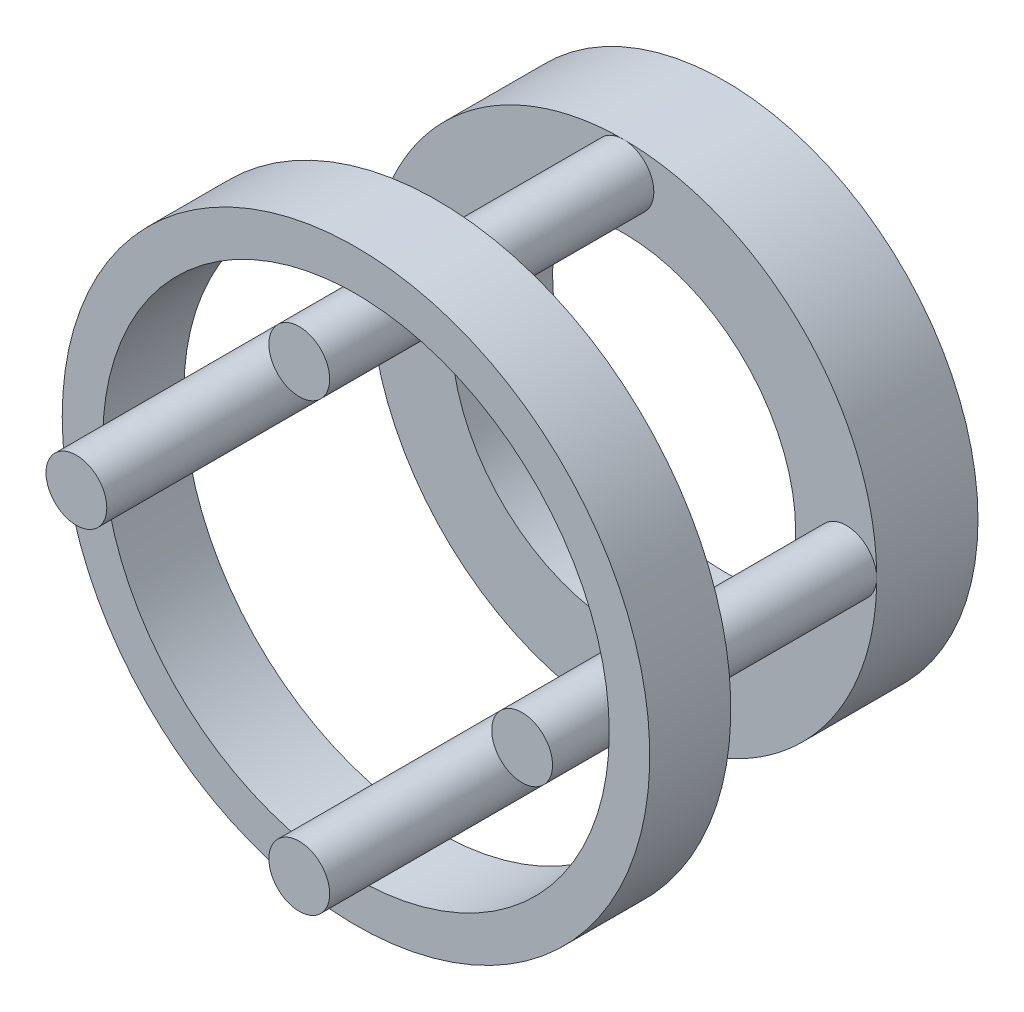
ISO-10303-21;
HEADER;
FILE_DESCRIPTION(('STEP AP214'),'2;1');
FILE_NAME('part.step','',(''),(''),'','','');
FILE_SCHEMA(('AUTOMOTIVE_DESIGN { 1 0 10303 214 1 1 1 1 }'));
ENDSEC;
DATA;
#1=APPLICATION_CONTEXT('core data for automotive mechanical design processes');
#2=APPLICATION_PROTOCOL_DEFINITION('international standard','automotive_design',2000,#1);
#3=PRODUCT_CONTEXT('',#1,'mechanical');
#4=PRODUCT('Part','Part','',(#3));
#5=PRODUCT_RELATED_PRODUCT_CATEGORY('part','',(#4));
#6=PRODUCT_DEFINITION_FORMATION('','',#4);
#7=PRODUCT_DEFINITION_CONTEXT('part definition',#1,'design');
#8=PRODUCT_DEFINITION('design','',#6,#7);
#9=PRODUCT_DEFINITION_SHAPE('','',#8);
#10=(LENGTH_UNIT() NAMED_UNIT(*) SI_UNIT(.MILLI.,.METRE.));
#11=(NAMED_UNIT(*) PLANE_ANGLE_UNIT() SI_UNIT($,.RADIAN.));
#12=(NAMED_UNIT(*) SI_UNIT($,.STERADIAN.) SOLID_ANGLE_UNIT());
#13=UNCERTAINTY_MEASURE_WITH_UNIT(LENGTH_MEASURE(1.E-05),#10,'distance_accuracy_value','');
#14=(GEOMETRIC_REPRESENTATION_CONTEXT(3) GLOBAL_UNCERTAINTY_ASSIGNED_CONTEXT((#13)) GLOBAL_UNIT_ASSIGNED_CONTEXT((#10,
#11,#12)) REPRESENTATION_CONTEXT('',''));
#15=CARTESIAN_POINT('',(0.,0.,0.));
#16=DIRECTION('',(0.,0.,1.));
#17=DIRECTION('',(1.,0.,0.));
#18=AXIS2_PLACEMENT_3D('',#15,#16,#17);
#19=CARTESIAN_POINT('',(1.13123995378518E-13,0.,16.2));
#20=DIRECTION('',(0.,0.,-1.));
#21=DIRECTION('',(-1.,0.,0.));
#22=AXIS2_PLACEMENT_3D('',#19,#20,#21);
#23=CYLINDRICAL_SURFACE('',#22,14.5);
#24=CARTESIAN_POINT('',(1.13123995378518E-13,0.,16.2));
#25=DIRECTION('',(0.,0.,-1.));
#26=DIRECTION('',(-1.,0.,0.));
#27=AXIS2_PLACEMENT_3D('',#24,#25,#26);
#28=CIRCLE('',#27,14.5);
#29=CARTESIAN_POINT('',(-14.4999999999999,0.,16.2000000000001));
#30=VERTEX_POINT('',#29);
#31=EDGE_CURVE('E11',#30,#30,#28,.T.);
#32=ORIENTED_EDGE('',*,*,#31,.T.);
#33=EDGE_LOOP('',(#32));
#34=FACE_BOUND('',#33,.T.);
#35=CARTESIAN_POINT('',(0.,0.,12.2));
#36=DIRECTION('',(0.,0.,-1.));
#37=DIRECTION('',(-1.,0.,0.));
#38=AXIS2_PLACEMENT_3D('',#35,#36,#37);
#39=CIRCLE('',#38,14.5);
#40=CARTESIAN_POINT('',(-14.4999999999999,0.,12.2000000000001));
#41=VERTEX_POINT('',#40);
#42=EDGE_CURVE('E48',#41,#41,#39,.T.);
#43=ORIENTED_EDGE('',*,*,#42,.F.);
#44=EDGE_LOOP('',(#43));
#45=FACE_BOUND('',#44,.T.);
#46=ADVANCED_FACE('F45',(#34,#45),#23,.T.);
#47=CARTESIAN_POINT('',(1.13123995378518E-13,0.,16.2));
#48=DIRECTION('',(0.,0.,-1.));
#49=DIRECTION('',(-1.,0.,0.));
#50=AXIS2_PLACEMENT_3D('',#47,#48,#49);
#51=PLANE('',#50);
#52=CARTESIAN_POINT('',(1.13123995378518E-13,0.,16.2));
#53=DIRECTION('',(0.,0.,-1.));
#54=DIRECTION('',(-1.,0.,0.));
#55=AXIS2_PLACEMENT_3D('',#52,#53,#54);
#56=CIRCLE('',#55,12.5);
#57=CARTESIAN_POINT('',(-12.4999999999999,0.,16.2000000000001));
#58=VERTEX_POINT('',#57);
#59=EDGE_CURVE('E55',#58,#58,#56,.T.);
#60=ORIENTED_EDGE('',*,*,#59,.T.);
#61=EDGE_LOOP('',(#60));
#62=FACE_BOUND('',#61,.T.);
#63=ORIENTED_EDGE('',*,*,#31,.F.);
#64=EDGE_LOOP('',(#63));
#65=FACE_BOUND('',#64,.T.);
#66=ADVANCED_FACE('F63',(#62,#65),#51,.F.);
#67=CARTESIAN_POINT('',(0.,0.,12.2));
#68=DIRECTION('',(0.,0.,-1.));
#69=DIRECTION('',(-1.,0.,0.));
#70=AXIS2_PLACEMENT_3D('',#67,#68,#69);
#71=PLANE('',#70);
#72=CARTESIAN_POINT('',(0.,0.,12.2));
#73=DIRECTION('',(0.,0.,-1.));
#74=DIRECTION('',(-1.,0.,0.));
#75=AXIS2_PLACEMENT_3D('',#72,#73,#74);
#76=CIRCLE('',#75,12.5);
#77=CARTESIAN_POINT('',(-12.4999999999999,0.,12.2000000000001));
#78=VERTEX_POINT('',#77);
#79=EDGE_CURVE('E57',#78,#78,#76,.T.);
#80=ORIENTED_EDGE('',*,*,#79,.F.);
#81=EDGE_LOOP('',(#80));
#82=FACE_BOUND('',#81,.T.);
#83=ORIENTED_EDGE('',*,*,#42,.T.);
#84=EDGE_LOOP('',(#83));
#85=FACE_BOUND('',#84,.T.);
#86=ADVANCED_FACE('F69',(#82,#85),#71,.T.);
#87=CARTESIAN_POINT('',(1.13123995378518E-13,0.,16.2));
#88=DIRECTION('',(0.,0.,-1.));
#89=DIRECTION('',(-1.,0.,0.));
#90=AXIS2_PLACEMENT_3D('',#87,#88,#89);
#91=CYLINDRICAL_SURFACE('',#90,12.5);
#92=ORIENTED_EDGE('',*,*,#59,.F.);
#93=EDGE_LOOP('',(#92));
#94=FACE_BOUND('',#93,.T.);
#95=ORIENTED_EDGE('',*,*,#79,.T.);
#96=EDGE_LOOP('',(#95));
#97=FACE_BOUND('',#96,.T.);
#98=ADVANCED_FACE('F66',(#94,#97),#91,.F.);
#99=CLOSED_SHELL('',(#46,#66,#86,#98));
#100=MANIFOLD_SOLID_BREP('B2',#99);
#101=CARTESIAN_POINT('',(0.,0.,21.));
#102=DIRECTION('',(0.,0.,-1.));
#103=DIRECTION('',(-1.,0.,0.));
#104=AXIS2_PLACEMENT_3D('',#101,#102,#103);
#105=CYLINDRICAL_SURFACE('',#104,8.5);
#106=CARTESIAN_POINT('',(0.,0.,3.));
#107=DIRECTION('',(0.,0.,1.));
#108=DIRECTION('',(1.,0.,0.));
#109=AXIS2_PLACEMENT_3D('',#106,#107,#108);
#110=CIRCLE('',#109,8.5);
#111=CARTESIAN_POINT('',(8.5,0.,3.));
#112=VERTEX_POINT('',#111);
#113=EDGE_CURVE('E154',#112,#112,#110,.T.);
#114=ORIENTED_EDGE('',*,*,#113,.T.);
#115=EDGE_LOOP('',(#114));
#116=FACE_BOUND('',#115,.T.);
#117=CARTESIAN_POINT('',(0.,0.,-2.));
#118=DIRECTION('',(0.,0.,-1.));
#119=DIRECTION('',(-1.,0.,0.));
#120=AXIS2_PLACEMENT_3D('',#117,#118,#119);
#121=CIRCLE('',#120,8.5);
#122=CARTESIAN_POINT('',(-8.5,0.,-2.));
#123=VERTEX_POINT('',#122);
#124=EDGE_CURVE('E157',#123,#123,#121,.T.);
#125=ORIENTED_EDGE('',*,*,#124,.T.);
#126=EDGE_LOOP('',(#125));
#127=FACE_BOUND('',#126,.T.);
#128=CARTESIAN_POINT('',(0.,8.5,-1.));
#129=CARTESIAN_POINT('',(0.0835602073116834,8.49999852465812,-0.999996717869099));
#130=CARTESIAN_POINT('',(0.167164170899166,8.49875504437695,-0.992994100099585));
#131=CARTESIAN_POINT('',(0.33202220467292,8.49391434547826,-0.965183206858253));
#132=CARTESIAN_POINT('',(0.413274128543538,8.49031504366607,-0.94436271235211));
#133=CARTESIAN_POINT('',(0.571019510053261,8.4811659180518,-0.889568486706681));
#134=CARTESIAN_POINT('',(0.647516980962109,8.47561776634704,-0.855606028734362));
#135=CARTESIAN_POINT('',(0.793719300559721,8.4631790616307,-0.775522622724672));
#136=CARTESIAN_POINT('',(0.863424820850616,8.45628864154791,-0.729402878499389));
#137=CARTESIAN_POINT('',(0.994816516549549,8.44184556474541,-0.625791329152744));
#138=CARTESIAN_POINT('',(1.05641975336287,8.43428721228608,-0.568195130975254));
#139=CARTESIAN_POINT('',(1.1691412650637,8.41940313016037,-0.443490270209336));
#140=CARTESIAN_POINT('',(1.22025883768728,8.4120774161024,-0.376380971001828));
#141=CARTESIAN_POINT('',(1.31089615224234,8.39843282674879,-0.233977605328771));
#142=CARTESIAN_POINT('',(1.35033279728854,8.39212130489153,-0.158629882811877));
#143=CARTESIAN_POINT('',(1.41595715270317,8.38129933378098,-0.00224905695329695));
#144=CARTESIAN_POINT('',(1.44214587005801,8.37678874764249,0.0787836137372771));
#145=CARTESIAN_POINT('',(1.48026740658905,8.37013636121934,0.243351056897079));
#146=CARTESIAN_POINT('',(1.49234409471487,8.36797067223513,0.326851518252889));
#147=CARTESIAN_POINT('',(1.50234505486158,8.36618114129228,0.494719511051763));
#148=CARTESIAN_POINT('',(1.50027044993802,8.36655709762705,0.579086973158516));
#149=CARTESIAN_POINT('',(1.48214465879202,8.36978659532625,0.745260132544038));
#150=CARTESIAN_POINT('',(1.46625598617925,8.37261132730482,0.827084198377329));
#151=CARTESIAN_POINT('',(1.42120852873224,8.38037493445764,0.986886731809982));
#152=CARTESIAN_POINT('',(1.39204923880641,8.38531389010072,1.06486505291164));
#153=CARTESIAN_POINT('',(1.32112618145376,8.39678011228507,1.21524406020266));
#154=CARTESIAN_POINT('',(1.27929578300233,8.40331573888177,1.28761265758428));
#155=CARTESIAN_POINT('',(1.18426514162452,8.41723322878403,1.424365020684));
#156=CARTESIAN_POINT('',(1.13106387280683,8.42461516841691,1.4887480651087));
#157=CARTESIAN_POINT('',(1.01392044402847,8.43951963661095,1.60864164658016));
#158=CARTESIAN_POINT('',(0.949839043227182,8.44704269154381,1.66401616129575));
#159=CARTESIAN_POINT('',(0.813223017047741,8.46128697681384,1.76324817775364));
#160=CARTESIAN_POINT('',(0.740688324257969,8.46800820075587,1.80710558764256));
#161=CARTESIAN_POINT('',(0.589090433497639,8.47990283414647,1.88207429866867));
#162=CARTESIAN_POINT('',(0.510020681297824,8.48507466502145,1.91317261224663));
#163=CARTESIAN_POINT('',(0.347668482380527,8.49327535201155,1.96160899664189));
#164=CARTESIAN_POINT('',(0.264386432134315,8.49630440940878,1.97894835992925));
#165=CARTESIAN_POINT('',(0.0971451116191678,8.49985092576813,1.99918799858364));
#166=CARTESIAN_POINT('',(0.0132090843615062,8.50040083433622,2.00227483840597));
#167=CARTESIAN_POINT('',(-0.153980271251543,8.49901631664242,1.99442058705648));
#168=CARTESIAN_POINT('',(-0.237233629020517,8.49708199798832,1.98348010349791));
#169=CARTESIAN_POINT('',(-0.400111048540306,8.49096650695861,1.94803692265988));
#170=CARTESIAN_POINT('',(-0.47975604295781,8.48680079660993,1.92362752117116));
#171=CARTESIAN_POINT('',(-0.633823333081784,8.47668767054273,1.86203953958819));
#172=CARTESIAN_POINT('',(-0.708245306379777,8.47074014495488,1.82486017205849));
#173=CARTESIAN_POINT('',(-0.850557919353286,8.45764232694309,1.7383669278635));
#174=CARTESIAN_POINT('',(-0.918377380876573,8.45048081539685,1.68893767003234));
#175=CARTESIAN_POINT('',(-1.04482575376699,8.43578086254215,1.57950528765994));
#176=CARTESIAN_POINT('',(-1.10345391044434,8.42824239034875,1.51950129569514));
#177=CARTESIAN_POINT('',(-1.21055495751759,8.41353196779635,1.38978231114828));
#178=CARTESIAN_POINT('',(-1.25890120329949,8.40636532837837,1.31996205624061));
#179=CARTESIAN_POINT('',(-1.34317887649159,8.39331262284436,1.17308156616709));
#180=CARTESIAN_POINT('',(-1.37911073038509,8.38742651273966,1.09602157983026));
#181=CARTESIAN_POINT('',(-1.43735470236499,8.37764200573802,0.937188281839137));
#182=CARTESIAN_POINT('',(-1.45972757437841,8.3737347552807,0.855437819007449));
#183=CARTESIAN_POINT('',(-1.49040804698522,8.36832903130758,0.689263765225145));
#184=CARTESIAN_POINT('',(-1.4987170345307,8.36683032026719,0.604840438703584));
#185=CARTESIAN_POINT('',(-1.50099164151106,8.36642243845549,0.436983475202302));
#186=CARTESIAN_POINT('',(-1.49515678461176,8.36747724556747,0.353552563196774));
#187=CARTESIAN_POINT('',(-1.46974322873663,8.37197817944576,0.188880052857927));
#188=CARTESIAN_POINT('',(-1.45016459057914,8.37542429563017,0.107638444838258));
#189=CARTESIAN_POINT('',(-1.39789926667029,8.38430518558531,-0.0502583454523233));
#190=CARTESIAN_POINT('',(-1.36523178909751,8.38973704421377,-0.126920060209434));
#191=CARTESIAN_POINT('',(-1.2877371522897,8.40197983656061,-0.273706869481977));
#192=CARTESIAN_POINT('',(-1.24290927156669,8.40879085209956,-0.343831575818837));
#193=CARTESIAN_POINT('',(-1.1416626166475,8.42313765215559,-0.476557976598531));
#194=CARTESIAN_POINT('',(-1.0850977566265,8.43068186379938,-0.539047340121705));
#195=CARTESIAN_POINT('',(-0.962289483399125,8.44557973306429,-0.653714728483759));
#196=CARTESIAN_POINT('',(-0.896043845959503,8.45293334643561,-0.705890377168245));
#197=CARTESIAN_POINT('',(-0.755134398648691,8.46668871310451,-0.798827343927911));
#198=CARTESIAN_POINT('',(-0.680408643630284,8.47308254914894,-0.83949593597092));
#199=CARTESIAN_POINT('',(-0.525100290133699,8.4841208835999,-0.907638613262307));
#200=CARTESIAN_POINT('',(-0.444523462097547,8.48876707834471,-0.935125500423164));
#201=CARTESIAN_POINT('',(-0.303055940544957,8.49480295232011,-0.970333091288652));
#202=CARTESIAN_POINT('',(-0.243008531002893,8.49674116179219,-0.981439826395929));
#203=CARTESIAN_POINT('',(-0.121981841577227,8.4993402109253,-0.996274402325779));
#204=CARTESIAN_POINT('',(-0.0610025810358457,8.50000107706366,-1.00000239609813));
#205=CARTESIAN_POINT('',(0.,8.5,-1.));
#206=B_SPLINE_CURVE_WITH_KNOTS('',3,(#128,#129,#130,#131,#132,#133,#134,#135,#136,#137,#138,
#139,#140,#141,#142,#143,#144,#145,#146,#147,#148,#149,#150,#151,#152,#153,#154,#155,#156,#157,
#158,#159,#160,#161,#162,#163,#164,#165,#166,#167,#168,#169,#170,#171,#172,#173,#174,#175,#176,
#177,#178,#179,#180,#181,#182,#183,#184,#185,#186,#187,#188,#189,#190,#191,#192,#193,#194,#195,
#196,#197,#198,#199,#200,#201,#202,#203,#204,#205),.UNSPECIFIED.,.T.,.F.,(4,2,2,2,2,2,2,2,2,2,2,
2,2,2,2,2,2,2,2,2,2,2,2,2,2,2,2,2,2,2,2,2,2,2,2,2,2,2,4),(0.,0.250457591265239,
0.501136955741326,0.751601762620913,1.0020417778349,1.25487340234721,1.50772195440904,
1.76232827341925,2.01691523667498,2.26888345171767,2.52083167063642,2.76985538403527,
3.01888857629236,3.26925473797252,3.51964349748054,3.7735186488756,4.02739582496181,
4.28153078678122,4.53564187317985,4.78641705372855,5.03718137196445,5.2862301259127,
5.53529423973253,5.78679991739404,6.0383262351567,6.29279109855223,6.54724721920708,
6.80055459873066,7.05383699613265,7.30356724592812,7.55329639063616,7.80266038647828,
8.05203918055447,8.30473127243323,8.55748151381616,8.81221395085161,9.06669849128299,
9.24954720252122,9.43239212355177),.UNSPECIFIED.);
#207=CARTESIAN_POINT('',(0.,8.5,-1.));
#208=VERTEX_POINT('',#207);
#209=EDGE_CURVE('E111',#208,#208,#206,.T.);
#210=ORIENTED_EDGE('',*,*,#209,.F.);
#211=EDGE_LOOP('',(#210));
#212=FACE_BOUND('',#211,.T.);
#213=ADVANCED_FACE('F107',(#116,#127,#212),#105,.F.);
#214=CARTESIAN_POINT('',(0.,0.,-2.));
#215=DIRECTION('',(0.,0.,1.));
#216=DIRECTION('',(1.,0.,0.));
#217=AXIS2_PLACEMENT_3D('',#214,#215,#216);
#218=CYLINDRICAL_SURFACE('',#217,12.5);
#219=CARTESIAN_POINT('',(0.,0.,-2.));
#220=DIRECTION('',(0.,0.,1.));
#221=DIRECTION('',(1.,0.,0.));
#222=AXIS2_PLACEMENT_3D('',#219,#220,#221);
#223=CIRCLE('',#222,12.5);
#224=CARTESIAN_POINT('',(12.5,0.,-2.));
#225=VERTEX_POINT('',#224);
#226=EDGE_CURVE('E43',#225,#225,#223,.T.);
#227=ORIENTED_EDGE('',*,*,#226,.T.);
#228=EDGE_LOOP('',(#227));
#229=FACE_BOUND('',#228,.T.);
#230=CARTESIAN_POINT('',(0.,0.,3.));
#231=DIRECTION('',(0.,0.,1.));
#232=DIRECTION('',(1.,0.,0.));
#233=AXIS2_PLACEMENT_3D('',#230,#231,#232);
#234=CIRCLE('',#233,12.5);
#235=CARTESIAN_POINT('',(0.,12.5,3.));
#236=VERTEX_POINT('',#235);
#237=CARTESIAN_POINT('',(-12.5,-3.54505963630593E-13,3.));
#238=VERTEX_POINT('',#237);
#239=EDGE_CURVE('E121',#236,#238,#234,.T.);
#240=ORIENTED_EDGE('',*,*,#239,.F.);
#241=CARTESIAN_POINT('',(12.5,3.52975155131639E-13,3.));
#242=VERTEX_POINT('',#241);
#243=EDGE_CURVE('E143',#242,#236,#234,.T.);
#244=ORIENTED_EDGE('',*,*,#243,.F.);
#245=CARTESIAN_POINT('',(7.05950310263298E-13,-12.5,3.));
#246=VERTEX_POINT('',#245);
#247=EDGE_CURVE('E153',#246,#242,#234,.T.);
#248=ORIENTED_EDGE('',*,*,#247,.F.);
#249=EDGE_CURVE('E133',#238,#246,#234,.T.);
#250=ORIENTED_EDGE('',*,*,#249,.F.);
#251=EDGE_LOOP('',(#240,#244,#248,#250));
#252=FACE_BOUND('',#251,.T.);
#253=ADVANCED_FACE('F109',(#229,#252),#218,.T.);
#254=CARTESIAN_POINT('',(0.,0.,-2.));
#255=DIRECTION('',(0.,0.,1.));
#256=DIRECTION('',(1.,0.,0.));
#257=AXIS2_PLACEMENT_3D('',#254,#255,#256);
#258=PLANE('',#257);
#259=ORIENTED_EDGE('',*,*,#124,.F.);
#260=EDGE_LOOP('',(#259));
#261=FACE_BOUND('',#260,.T.);
#262=ORIENTED_EDGE('',*,*,#226,.F.);
#263=EDGE_LOOP('',(#262));
#264=FACE_BOUND('',#263,.T.);
#265=ADVANCED_FACE('F197',(#261,#264),#258,.F.);
#266=CARTESIAN_POINT('',(0.,0.,3.));
#267=DIRECTION('',(0.,0.,1.));
#268=DIRECTION('',(1.,0.,0.));
#269=AXIS2_PLACEMENT_3D('',#266,#267,#268);
#270=PLANE('',#269);
#271=ORIENTED_EDGE('',*,*,#113,.F.);
#272=EDGE_LOOP('',(#271));
#273=FACE_BOUND('',#272,.T.);
#274=ORIENTED_EDGE('',*,*,#239,.T.);
#275=CARTESIAN_POINT('',(-10.9999999999997,-3.11965247994913E-13,3.));
#276=DIRECTION('',(0.,0.,1.));
#277=DIRECTION('',(1.,0.,0.));
#278=AXIS2_PLACEMENT_3D('',#275,#276,#277);
#279=CIRCLE('',#278,1.5000000000005);
#280=EDGE_CURVE('E127',#238,#238,#279,.T.);
#281=ORIENTED_EDGE('',*,*,#280,.F.);
#282=ORIENTED_EDGE('',*,*,#249,.T.);
#283=CARTESIAN_POINT('',(6.21236273031702E-13,-11.,3.));
#284=DIRECTION('',(0.,0.,1.));
#285=DIRECTION('',(1.,0.,0.));
#286=AXIS2_PLACEMENT_3D('',#283,#284,#285);
#287=CIRCLE('',#286,1.50000000000067);
#288=EDGE_CURVE('E176',#246,#246,#287,.T.);
#289=ORIENTED_EDGE('',*,*,#288,.F.);
#290=ORIENTED_EDGE('',*,*,#247,.T.);
#291=CARTESIAN_POINT('',(11.0000000000003,3.10618136515851E-13,3.));
#292=DIRECTION('',(0.,0.,1.));
#293=DIRECTION('',(1.,0.,0.));
#294=AXIS2_PLACEMENT_3D('',#291,#292,#293);
#295=CIRCLE('',#294,1.50000000000024);
#296=EDGE_CURVE('E150',#242,#242,#295,.T.);
#297=ORIENTED_EDGE('',*,*,#296,.F.);
#298=ORIENTED_EDGE('',*,*,#243,.T.);
#299=CARTESIAN_POINT('',(0.,11.,3.));
#300=DIRECTION('',(0.,0.,1.));
#301=DIRECTION('',(1.,0.,0.));
#302=AXIS2_PLACEMENT_3D('',#299,#300,#301);
#303=CIRCLE('',#302,1.5);
#304=EDGE_CURVE('E148',#236,#236,#303,.T.);
#305=ORIENTED_EDGE('',*,*,#304,.F.);
#306=EDGE_LOOP('',(#274,#281,#282,#289,#290,#297,#298,#305));
#307=FACE_BOUND('',#306,.T.);
#308=ADVANCED_FACE('F146',(#273,#307),#270,.T.);
#309=CARTESIAN_POINT('',(0.,11.,19.));
#310=DIRECTION('',(0.,0.,-1.));
#311=DIRECTION('',(-1.,0.,0.));
#312=AXIS2_PLACEMENT_3D('',#309,#310,#311);
#313=CYLINDRICAL_SURFACE('',#312,1.5);
#314=CARTESIAN_POINT('',(0.,11.,19.));
#315=DIRECTION('',(0.,0.,1.));
#316=DIRECTION('',(1.,0.,0.));
#317=AXIS2_PLACEMENT_3D('',#314,#315,#316);
#318=CIRCLE('',#317,1.5);
#319=CARTESIAN_POINT('',(1.5,11.,19.));
#320=VERTEX_POINT('',#319);
#321=EDGE_CURVE('E163',#320,#320,#318,.T.);
#322=ORIENTED_EDGE('',*,*,#321,.F.);
#323=EDGE_LOOP('',(#322));
#324=FACE_BOUND('',#323,.T.);
#325=ORIENTED_EDGE('',*,*,#304,.T.);
#326=EDGE_LOOP('',(#325));
#327=FACE_BOUND('',#326,.T.);
#328=ADVANCED_FACE('F202',(#324,#327),#313,.T.);
#329=CARTESIAN_POINT('',(0.,11.,19.));
#330=DIRECTION('',(0.,0.,1.));
#331=DIRECTION('',(1.,0.,0.));
#332=AXIS2_PLACEMENT_3D('',#329,#330,#331);
#333=PLANE('',#332);
#334=ORIENTED_EDGE('',*,*,#321,.T.);
#335=EDGE_LOOP('',(#334));
#336=FACE_BOUND('',#335,.T.);
#337=ADVANCED_FACE('F224',(#336),#333,.T.);
#338=CARTESIAN_POINT('',(11.0000000000003,3.10618136515851E-13,19.));
#339=DIRECTION('',(0.,0.,-1.));
#340=DIRECTION('',(-1.,0.,0.));
#341=AXIS2_PLACEMENT_3D('',#338,#339,#340);
#342=CYLINDRICAL_SURFACE('',#341,1.50000000000024);
#343=CARTESIAN_POINT('',(11.0000000000003,3.10618136515851E-13,19.));
#344=DIRECTION('',(0.,0.,1.));
#345=DIRECTION('',(1.,0.,0.));
#346=AXIS2_PLACEMENT_3D('',#343,#344,#345);
#347=CIRCLE('',#346,1.50000000000024);
#348=CARTESIAN_POINT('',(12.5000000000006,3.10618136515851E-13,19.));
#349=VERTEX_POINT('',#348);
#350=EDGE_CURVE('E170',#349,#349,#347,.T.);
#351=ORIENTED_EDGE('',*,*,#350,.F.);
#352=EDGE_LOOP('',(#351));
#353=FACE_BOUND('',#352,.T.);
#354=ORIENTED_EDGE('',*,*,#296,.T.);
#355=EDGE_LOOP('',(#354));
#356=FACE_BOUND('',#355,.T.);
#357=ADVANCED_FACE('F231',(#353,#356),#342,.T.);
#358=CARTESIAN_POINT('',(11.0000000000003,3.10618136515851E-13,19.));
#359=DIRECTION('',(0.,0.,1.));
#360=DIRECTION('',(1.,0.,0.));
#361=AXIS2_PLACEMENT_3D('',#358,#359,#360);
#362=PLANE('',#361);
#363=ORIENTED_EDGE('',*,*,#350,.T.);
#364=EDGE_LOOP('',(#363));
#365=FACE_BOUND('',#364,.T.);
#366=ADVANCED_FACE('F237',(#365),#362,.T.);
#367=CARTESIAN_POINT('',(6.21236273031702E-13,-11.,19.));
#368=DIRECTION('',(0.,0.,-1.));
#369=DIRECTION('',(-1.,0.,0.));
#370=AXIS2_PLACEMENT_3D('',#367,#368,#369);
#371=CYLINDRICAL_SURFACE('',#370,1.50000000000067);
#372=CARTESIAN_POINT('',(6.21236273031702E-13,-11.,19.));
#373=DIRECTION('',(0.,0.,1.));
#374=DIRECTION('',(1.,0.,0.));
#375=AXIS2_PLACEMENT_3D('',#372,#373,#374);
#376=CIRCLE('',#375,1.50000000000067);
#377=CARTESIAN_POINT('',(1.50000000000129,-11.,19.));
#378=VERTEX_POINT('',#377);
#379=EDGE_CURVE('E173',#378,#378,#376,.T.);
#380=ORIENTED_EDGE('',*,*,#379,.F.);
#381=EDGE_LOOP('',(#380));
#382=FACE_BOUND('',#381,.T.);
#383=ORIENTED_EDGE('',*,*,#288,.T.);
#384=EDGE_LOOP('',(#383));
#385=FACE_BOUND('',#384,.T.);
#386=ADVANCED_FACE('F245',(#382,#385),#371,.T.);
#387=CARTESIAN_POINT('',(6.21236273031702E-13,-11.,19.));
#388=DIRECTION('',(0.,0.,1.));
#389=DIRECTION('',(1.,0.,0.));
#390=AXIS2_PLACEMENT_3D('',#387,#388,#389);
#391=PLANE('',#390);
#392=ORIENTED_EDGE('',*,*,#379,.T.);
#393=EDGE_LOOP('',(#392));
#394=FACE_BOUND('',#393,.T.);
#395=ADVANCED_FACE('F253',(#394),#391,.T.);
#396=CARTESIAN_POINT('',(-10.9999999999997,-3.11965247994913E-13,19.));
#397=DIRECTION('',(0.,0.,-1.));
#398=DIRECTION('',(-1.,0.,0.));
#399=AXIS2_PLACEMENT_3D('',#396,#397,#398);
#400=CYLINDRICAL_SURFACE('',#399,1.5000000000005);
#401=CARTESIAN_POINT('',(-10.9999999999997,-3.11965247994913E-13,19.));
#402=DIRECTION('',(0.,0.,1.));
#403=DIRECTION('',(1.,0.,0.));
#404=AXIS2_PLACEMENT_3D('',#401,#402,#403);
#405=CIRCLE('',#404,1.5000000000005);
#406=CARTESIAN_POINT('',(-9.49999999999919,-3.11965247994913E-13,19.));
#407=VERTEX_POINT('',#406);
#408=EDGE_CURVE('E178',#407,#407,#405,.T.);
#409=ORIENTED_EDGE('',*,*,#408,.F.);
#410=EDGE_LOOP('',(#409));
#411=FACE_BOUND('',#410,.T.);
#412=ORIENTED_EDGE('',*,*,#280,.T.);
#413=EDGE_LOOP('',(#412));
#414=FACE_BOUND('',#413,.T.);
#415=ADVANCED_FACE('F261',(#411,#414),#400,.T.);
#416=CARTESIAN_POINT('',(-10.9999999999997,-3.11965247994913E-13,19.));
#417=DIRECTION('',(0.,0.,1.));
#418=DIRECTION('',(1.,0.,0.));
#419=AXIS2_PLACEMENT_3D('',#416,#417,#418);
#420=PLANE('',#419);
#421=ORIENTED_EDGE('',*,*,#408,.T.);
#422=EDGE_LOOP('',(#421));
#423=FACE_BOUND('',#422,.T.);
#424=ADVANCED_FACE('F269',(#423),#420,.T.);
#425=CARTESIAN_POINT('',(0.,11.,0.5));
#426=DIRECTION('',(0.,-1.,0.));
#427=DIRECTION('',(0.,0.,-1.));
#428=AXIS2_PLACEMENT_3D('',#425,#426,#427);
#429=CYLINDRICAL_SURFACE('',#428,1.5);
#430=CARTESIAN_POINT('',(0.,11.,0.5));
#431=DIRECTION('',(0.,1.,0.));
#432=DIRECTION('',(0.,0.,1.));
#433=AXIS2_PLACEMENT_3D('',#430,#431,#432);
#434=CIRCLE('',#433,1.5);
#435=CARTESIAN_POINT('',(0.,11.,2.));
#436=VERTEX_POINT('',#435);
#437=EDGE_CURVE('E184',#436,#436,#434,.T.);
#438=ORIENTED_EDGE('',*,*,#437,.T.);
#439=EDGE_LOOP('',(#438));
#440=FACE_BOUND('',#439,.T.);
#441=ORIENTED_EDGE('',*,*,#209,.T.);
#442=EDGE_LOOP('',(#441));
#443=FACE_BOUND('',#442,.T.);
#444=ADVANCED_FACE('F191',(#440,#443),#429,.F.);
#445=CARTESIAN_POINT('',(0.,11.,0.5));
#446=DIRECTION('',(0.,1.,0.));
#447=DIRECTION('',(0.,0.,1.));
#448=AXIS2_PLACEMENT_3D('',#445,#446,#447);
#449=PLANE('',#448);
#450=ORIENTED_EDGE('',*,*,#437,.F.);
#451=EDGE_LOOP('',(#450));
#452=FACE_BOUND('',#451,.T.);
#453=ADVANCED_FACE('F284',(#452),#449,.F.);
#454=CLOSED_SHELL('',(#213,#253,#265,#308,#328,#337,#357,#366,#386,#395,#415,#424,#444,#453));
#455=MANIFOLD_SOLID_BREP('B6',#454);
#456=ADVANCED_BREP_SHAPE_REPRESENTATION('',(#18,#100,#455),#14);
#457=SHAPE_DEFINITION_REPRESENTATION(#9,#456);
ENDSEC;
END-ISO-10303-21;
